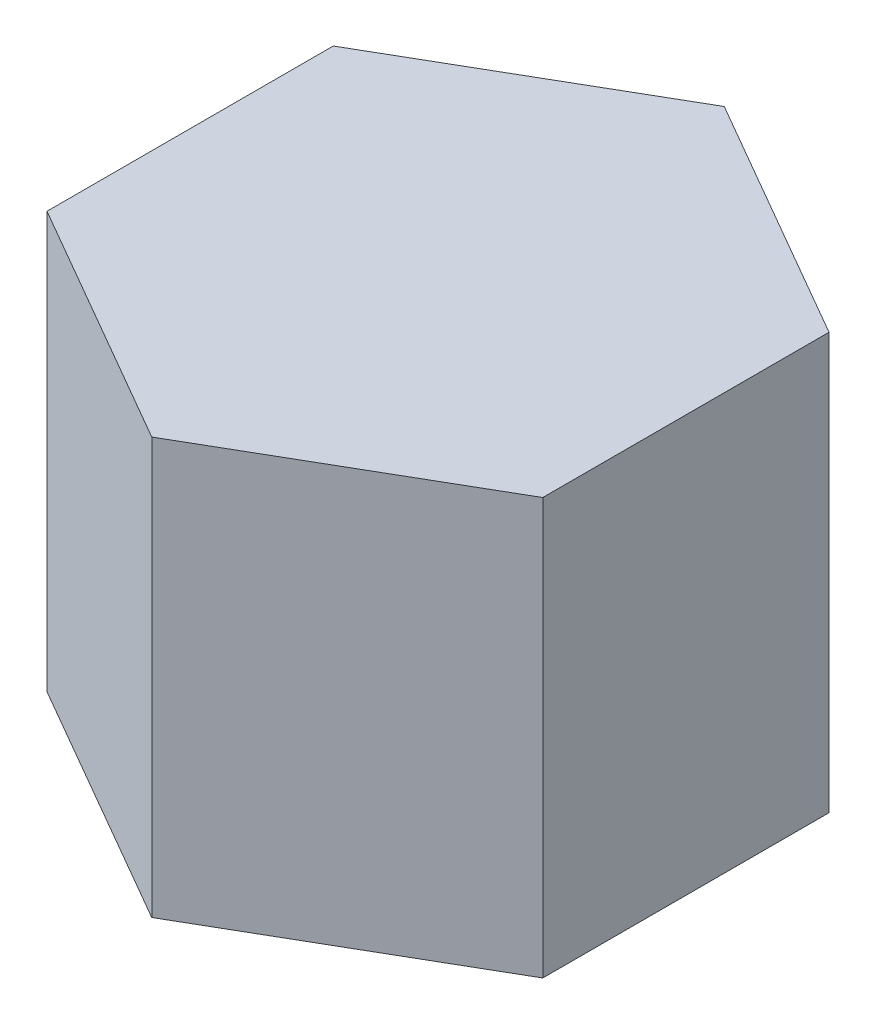
ISO-10303-21;
HEADER;
FILE_DESCRIPTION(('STEP AP214'),'2;1');
FILE_NAME('part.step','',(''),(''),'','','');
FILE_SCHEMA(('AUTOMOTIVE_DESIGN { 1 0 10303 214 1 1 1 1 }'));
ENDSEC;
DATA;
#1=APPLICATION_CONTEXT('core data for automotive mechanical design processes');
#2=APPLICATION_PROTOCOL_DEFINITION('international standard','automotive_design',2000,#1);
#3=PRODUCT_CONTEXT('',#1,'mechanical');
#4=PRODUCT('Part','Part','',(#3));
#5=PRODUCT_RELATED_PRODUCT_CATEGORY('part','',(#4));
#6=PRODUCT_DEFINITION_FORMATION('','',#4);
#7=PRODUCT_DEFINITION_CONTEXT('part definition',#1,'design');
#8=PRODUCT_DEFINITION('design','',#6,#7);
#9=PRODUCT_DEFINITION_SHAPE('','',#8);
#10=(LENGTH_UNIT() NAMED_UNIT(*) SI_UNIT(.MILLI.,.METRE.));
#11=(NAMED_UNIT(*) PLANE_ANGLE_UNIT() SI_UNIT($,.RADIAN.));
#12=(NAMED_UNIT(*) SI_UNIT($,.STERADIAN.) SOLID_ANGLE_UNIT());
#13=UNCERTAINTY_MEASURE_WITH_UNIT(LENGTH_MEASURE(1.E-05),#10,'distance_accuracy_value','');
#14=(GEOMETRIC_REPRESENTATION_CONTEXT(3) GLOBAL_UNCERTAINTY_ASSIGNED_CONTEXT((#13)) GLOBAL_UNIT_ASSIGNED_CONTEXT((#10,
#11,#12)) REPRESENTATION_CONTEXT('',''));
#15=CARTESIAN_POINT('',(0.,0.,0.));
#16=DIRECTION('',(0.,0.,1.));
#17=DIRECTION('',(1.,0.,0.));
#18=AXIS2_PLACEMENT_3D('',#15,#16,#17);
#19=CARTESIAN_POINT('',(204.839551417382,-147.556598747966,290.81594581671));
#20=DIRECTION('',(-0.500000000000096,0.,-0.866025403784383));
#21=DIRECTION('',(-0.866025403784383,0.,0.500000000000096));
#22=AXIS2_PLACEMENT_3D('',#19,#20,#21);
#23=PLANE('',#22);
#24=CARTESIAN_POINT('',(205.142660308706,-147.047793579175,290.64094581671));
#25=DIRECTION('',(-0.866025403784383,0.,0.500000000000096));
#26=VECTOR('',#25,1.);
#27=LINE('',#24,#26);
#28=CARTESIAN_POINT('',(205.142660308706,-147.047793579175,290.64094581671));
#29=VERTEX_POINT('',#28);
#30=CARTESIAN_POINT('',(204.839551417382,-147.047793579175,290.81594581671));
#31=VERTEX_POINT('',#30);
#32=EDGE_CURVE('E170',#29,#31,#27,.T.);
#33=ORIENTED_EDGE('',*,*,#32,.T.);
#34=CARTESIAN_POINT('',(204.839551417382,-147.556598747966,290.81594581671));
#35=DIRECTION('',(0.,1.,0.));
#36=VECTOR('',#35,1.);
#37=LINE('',#34,#36);
#38=CARTESIAN_POINT('',(204.839551417382,-147.556598747966,290.81594581671));
#39=VERTEX_POINT('',#38);
#40=EDGE_CURVE('E35',#39,#31,#37,.T.);
#41=ORIENTED_EDGE('',*,*,#40,.F.);
#42=CARTESIAN_POINT('',(205.142660308706,-147.556598747966,290.64094581671));
#43=DIRECTION('',(-0.866025403784383,0.,0.500000000000096));
#44=VECTOR('',#43,1.);
#45=LINE('',#42,#44);
#46=CARTESIAN_POINT('',(205.142660308706,-147.556598747966,290.64094581671));
#47=VERTEX_POINT('',#46);
#48=EDGE_CURVE('E159',#47,#39,#45,.T.);
#49=ORIENTED_EDGE('',*,*,#48,.F.);
#50=CARTESIAN_POINT('',(205.142660308706,-147.556598747966,290.64094581671));
#51=DIRECTION('',(0.,1.,0.));
#52=VECTOR('',#51,1.);
#53=LINE('',#50,#52);
#54=EDGE_CURVE('E10',#47,#29,#53,.T.);
#55=ORIENTED_EDGE('',*,*,#54,.T.);
#56=EDGE_LOOP('',(#33,#41,#49,#55));
#57=FACE_BOUND('',#56,.T.);
#58=ADVANCED_FACE('F16',(#57),#23,.F.);
#59=CARTESIAN_POINT('',(205.142660308706,-147.556598747966,291.594471220494));
#60=DIRECTION('',(-1.,0.,0.));
#61=DIRECTION('',(0.,-1.,0.));
#62=AXIS2_PLACEMENT_3D('',#59,#60,#61);
#63=PLANE('',#62);
#64=CARTESIAN_POINT('',(205.142660308706,-147.047793579175,290.29094581671));
#65=DIRECTION('',(0.,0.,1.));
#66=VECTOR('',#65,1.);
#67=LINE('',#64,#66);
#68=CARTESIAN_POINT('',(205.142660308706,-147.047793579175,290.29094581671));
#69=VERTEX_POINT('',#68);
#70=EDGE_CURVE('E167',#69,#29,#67,.T.);
#71=ORIENTED_EDGE('',*,*,#70,.T.);
#72=ORIENTED_EDGE('',*,*,#54,.F.);
#73=CARTESIAN_POINT('',(205.142660308706,-147.556598747966,290.29094581671));
#74=DIRECTION('',(0.,0.,1.));
#75=VECTOR('',#74,1.);
#76=LINE('',#73,#75);
#77=CARTESIAN_POINT('',(205.142660308706,-147.556598747966,290.29094581671));
#78=VERTEX_POINT('',#77);
#79=EDGE_CURVE('E156',#78,#47,#76,.T.);
#80=ORIENTED_EDGE('',*,*,#79,.F.);
#81=CARTESIAN_POINT('',(205.142660308706,-147.556598747966,290.29094581671));
#82=DIRECTION('',(0.,1.,0.));
#83=VECTOR('',#82,1.);
#84=LINE('',#81,#83);
#85=EDGE_CURVE('E27',#78,#69,#84,.T.);
#86=ORIENTED_EDGE('',*,*,#85,.T.);
#87=EDGE_LOOP('',(#71,#72,#80,#86));
#88=FACE_BOUND('',#87,.T.);
#89=ADVANCED_FACE('F189',(#88),#63,.F.);
#90=CARTESIAN_POINT('',(205.142660308706,-147.556598747966,290.29094581671));
#91=DIRECTION('',(-0.499999999999943,0.,0.866025403784471));
#92=DIRECTION('',(0.866025403784471,0.,0.499999999999943));
#93=AXIS2_PLACEMENT_3D('',#90,#91,#92);
#94=PLANE('',#93);
#95=CARTESIAN_POINT('',(204.839551417381,-147.047793579175,290.11594581671));
#96=DIRECTION('',(0.866025403784471,0.,0.499999999999943));
#97=VECTOR('',#96,1.);
#98=LINE('',#95,#97);
#99=CARTESIAN_POINT('',(204.839551417382,-147.047793579175,290.11594581671));
#100=VERTEX_POINT('',#99);
#101=EDGE_CURVE('E163',#100,#69,#98,.T.);
#102=ORIENTED_EDGE('',*,*,#101,.T.);
#103=ORIENTED_EDGE('',*,*,#85,.F.);
#104=CARTESIAN_POINT('',(204.839551417381,-147.556598747966,290.11594581671));
#105=DIRECTION('',(0.866025403784471,0.,0.499999999999943));
#106=VECTOR('',#105,1.);
#107=LINE('',#104,#106);
#108=CARTESIAN_POINT('',(204.839551417382,-147.556598747966,290.11594581671));
#109=VERTEX_POINT('',#108);
#110=EDGE_CURVE('E106',#109,#78,#107,.T.);
#111=ORIENTED_EDGE('',*,*,#110,.F.);
#112=CARTESIAN_POINT('',(204.839551417381,-147.556598747966,290.11594581671));
#113=DIRECTION('',(0.,1.,0.));
#114=VECTOR('',#113,1.);
#115=LINE('',#112,#114);
#116=EDGE_CURVE('E94',#109,#100,#115,.T.);
#117=ORIENTED_EDGE('',*,*,#116,.T.);
#118=EDGE_LOOP('',(#102,#103,#111,#117));
#119=FACE_BOUND('',#118,.T.);
#120=ADVANCED_FACE('F198',(#119),#94,.F.);
#121=CARTESIAN_POINT('',(204.839551417382,-147.556598747966,290.11594581671));
#122=DIRECTION('',(0.499999999999943,0.,0.866025403784471));
#123=DIRECTION('',(0.866025403784471,0.,-0.499999999999943));
#124=AXIS2_PLACEMENT_3D('',#121,#122,#123);
#125=PLANE('',#124);
#126=CARTESIAN_POINT('',(204.536442526057,-147.047793579175,290.29094581671));
#127=DIRECTION('',(0.866025403784471,0.,-0.499999999999943));
#128=VECTOR('',#127,1.);
#129=LINE('',#126,#128);
#130=CARTESIAN_POINT('',(204.536442526057,-147.047793579175,290.29094581671));
#131=VERTEX_POINT('',#130);
#132=EDGE_CURVE('E162',#131,#100,#129,.T.);
#133=ORIENTED_EDGE('',*,*,#132,.T.);
#134=ORIENTED_EDGE('',*,*,#116,.F.);
#135=CARTESIAN_POINT('',(204.536442526057,-147.556598747966,290.29094581671));
#136=DIRECTION('',(0.866025403784471,0.,-0.499999999999943));
#137=VECTOR('',#136,1.);
#138=LINE('',#135,#137);
#139=CARTESIAN_POINT('',(204.536442526057,-147.556598747966,290.29094581671));
#140=VERTEX_POINT('',#139);
#141=EDGE_CURVE('E98',#140,#109,#138,.T.);
#142=ORIENTED_EDGE('',*,*,#141,.F.);
#143=CARTESIAN_POINT('',(204.536442526057,-147.556598747966,290.29094581671));
#144=DIRECTION('',(0.,1.,0.));
#145=VECTOR('',#144,1.);
#146=LINE('',#143,#145);
#147=EDGE_CURVE('E79',#140,#131,#146,.T.);
#148=ORIENTED_EDGE('',*,*,#147,.T.);
#149=EDGE_LOOP('',(#133,#134,#142,#148));
#150=FACE_BOUND('',#149,.T.);
#151=ADVANCED_FACE('F100',(#150),#125,.F.);
#152=CARTESIAN_POINT('',(204.536442526057,-147.556598747966,291.594471220494));
#153=DIRECTION('',(1.,0.,0.));
#154=DIRECTION('',(0.,1.,0.));
#155=AXIS2_PLACEMENT_3D('',#152,#153,#154);
#156=PLANE('',#155);
#157=CARTESIAN_POINT('',(204.536442526057,-147.047793579175,290.64094581671));
#158=DIRECTION('',(0.,0.,-1.));
#159=VECTOR('',#158,1.);
#160=LINE('',#157,#159);
#161=CARTESIAN_POINT('',(204.536442526057,-147.047793579175,290.64094581671));
#162=VERTEX_POINT('',#161);
#163=EDGE_CURVE('E88',#162,#131,#160,.T.);
#164=ORIENTED_EDGE('',*,*,#163,.T.);
#165=ORIENTED_EDGE('',*,*,#147,.F.);
#166=CARTESIAN_POINT('',(204.536442526057,-147.556598747966,290.64094581671));
#167=DIRECTION('',(0.,0.,-1.));
#168=VECTOR('',#167,1.);
#169=LINE('',#166,#168);
#170=CARTESIAN_POINT('',(204.536442526057,-147.556598747966,290.64094581671));
#171=VERTEX_POINT('',#170);
#172=EDGE_CURVE('E84',#171,#140,#169,.T.);
#173=ORIENTED_EDGE('',*,*,#172,.F.);
#174=CARTESIAN_POINT('',(204.536442526057,-147.556598747966,290.64094581671));
#175=DIRECTION('',(0.,1.,0.));
#176=VECTOR('',#175,1.);
#177=LINE('',#174,#176);
#178=EDGE_CURVE('E58',#171,#162,#177,.T.);
#179=ORIENTED_EDGE('',*,*,#178,.T.);
#180=EDGE_LOOP('',(#164,#165,#173,#179));
#181=FACE_BOUND('',#180,.T.);
#182=ADVANCED_FACE('F82',(#181),#156,.F.);
#183=CARTESIAN_POINT('',(204.536442526057,-147.556598747966,290.64094581671));
#184=DIRECTION('',(0.500000000000062,0.,-0.866025403784403));
#185=DIRECTION('',(-0.866025403784403,0.,-0.500000000000062));
#186=AXIS2_PLACEMENT_3D('',#183,#184,#185);
#187=PLANE('',#186);
#188=CARTESIAN_POINT('',(204.839551417382,-147.047793579175,290.81594581671));
#189=DIRECTION('',(-0.866025403784403,0.,-0.500000000000062));
#190=VECTOR('',#189,1.);
#191=LINE('',#188,#190);
#192=EDGE_CURVE('E160',#31,#162,#191,.T.);
#193=ORIENTED_EDGE('',*,*,#192,.T.);
#194=ORIENTED_EDGE('',*,*,#178,.F.);
#195=CARTESIAN_POINT('',(204.839551417382,-147.556598747966,290.81594581671));
#196=DIRECTION('',(-0.866025403784403,0.,-0.500000000000062));
#197=VECTOR('',#196,1.);
#198=LINE('',#195,#197);
#199=EDGE_CURVE('E112',#39,#171,#198,.T.);
#200=ORIENTED_EDGE('',*,*,#199,.F.);
#201=ORIENTED_EDGE('',*,*,#40,.T.);
#202=EDGE_LOOP('',(#193,#194,#200,#201));
#203=FACE_BOUND('',#202,.T.);
#204=ADVANCED_FACE('F131',(#203),#187,.F.);
#205=CARTESIAN_POINT('',(206.491105863044,-147.556598747966,291.594471220494));
#206=DIRECTION('',(0.,1.,0.));
#207=DIRECTION('',(-1.,0.,0.));
#208=AXIS2_PLACEMENT_3D('',#205,#206,#207);
#209=PLANE('',#208);
#210=ORIENTED_EDGE('',*,*,#48,.T.);
#211=ORIENTED_EDGE('',*,*,#199,.T.);
#212=ORIENTED_EDGE('',*,*,#172,.T.);
#213=ORIENTED_EDGE('',*,*,#141,.T.);
#214=ORIENTED_EDGE('',*,*,#110,.T.);
#215=ORIENTED_EDGE('',*,*,#79,.T.);
#216=EDGE_LOOP('',(#210,#211,#212,#213,#214,#215));
#217=FACE_BOUND('',#216,.T.);
#218=ADVANCED_FACE('F111',(#217),#209,.F.);
#219=CARTESIAN_POINT('',(206.491105863044,-147.047793579175,291.594471220494));
#220=DIRECTION('',(0.,1.,0.));
#221=DIRECTION('',(-1.,0.,0.));
#222=AXIS2_PLACEMENT_3D('',#219,#220,#221);
#223=PLANE('',#222);
#224=ORIENTED_EDGE('',*,*,#32,.F.);
#225=ORIENTED_EDGE('',*,*,#70,.F.);
#226=ORIENTED_EDGE('',*,*,#101,.F.);
#227=ORIENTED_EDGE('',*,*,#132,.F.);
#228=ORIENTED_EDGE('',*,*,#163,.F.);
#229=ORIENTED_EDGE('',*,*,#192,.F.);
#230=EDGE_LOOP('',(#224,#225,#226,#227,#228,#229));
#231=FACE_BOUND('',#230,.T.);
#232=ADVANCED_FACE('F130',(#231),#223,.T.);
#233=CLOSED_SHELL('',(#58,#89,#120,#151,#182,#204,#218,#232));
#234=MANIFOLD_SOLID_BREP('B1',#233);
#235=ADVANCED_BREP_SHAPE_REPRESENTATION('',(#18,#234),#14);
#236=SHAPE_DEFINITION_REPRESENTATION(#9,#235);
ENDSEC;
END-ISO-10303-21;
